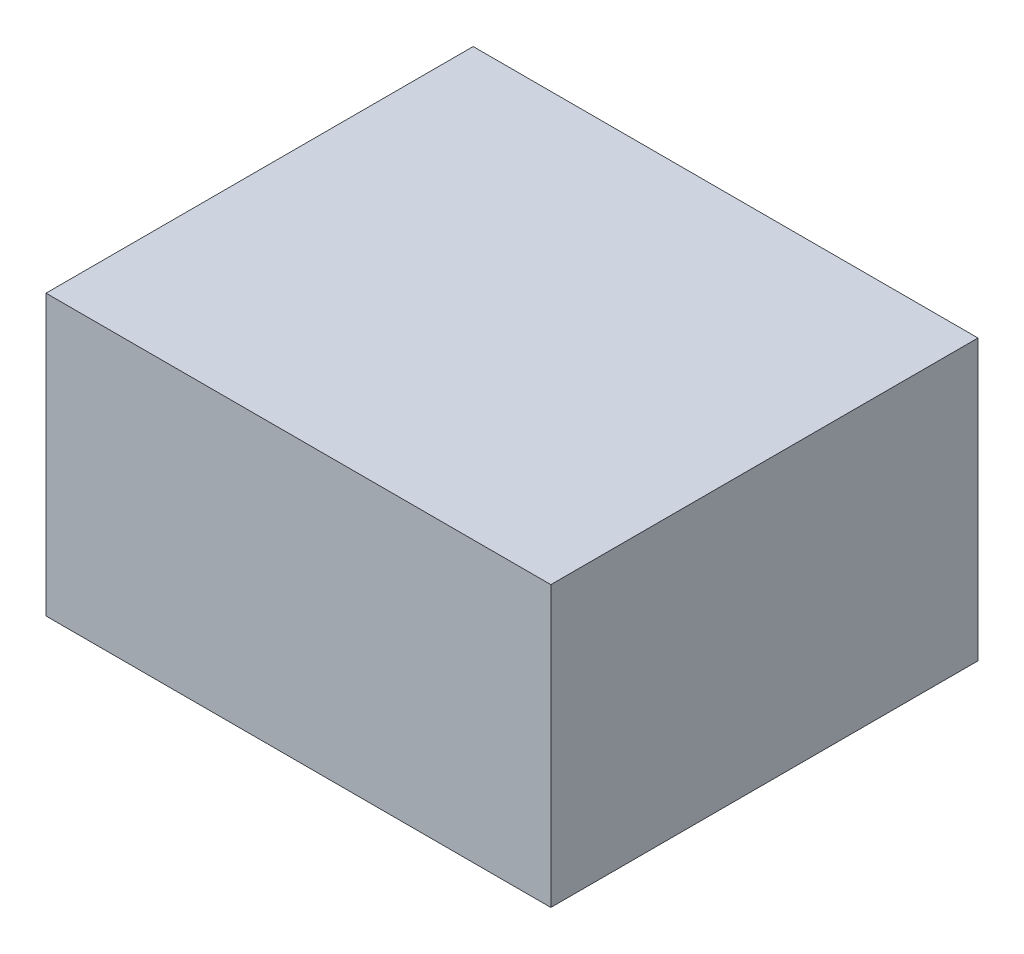
ISO-10303-21;
HEADER;
FILE_DESCRIPTION(('STEP AP214'),'2;1');
FILE_NAME('part.step','',(''),(''),'','','');
FILE_SCHEMA(('AUTOMOTIVE_DESIGN { 1 0 10303 214 1 1 1 1 }'));
ENDSEC;
DATA;
#1=APPLICATION_CONTEXT('core data for automotive mechanical design processes');
#2=APPLICATION_PROTOCOL_DEFINITION('international standard','automotive_design',2000,#1);
#3=PRODUCT_CONTEXT('',#1,'mechanical');
#4=PRODUCT('Part','Part','',(#3));
#5=PRODUCT_RELATED_PRODUCT_CATEGORY('part','',(#4));
#6=PRODUCT_DEFINITION_FORMATION('','',#4);
#7=PRODUCT_DEFINITION_CONTEXT('part definition',#1,'design');
#8=PRODUCT_DEFINITION('design','',#6,#7);
#9=PRODUCT_DEFINITION_SHAPE('','',#8);
#10=(LENGTH_UNIT() NAMED_UNIT(*) SI_UNIT(.MILLI.,.METRE.));
#11=(NAMED_UNIT(*) PLANE_ANGLE_UNIT() SI_UNIT($,.RADIAN.));
#12=(NAMED_UNIT(*) SI_UNIT($,.STERADIAN.) SOLID_ANGLE_UNIT());
#13=UNCERTAINTY_MEASURE_WITH_UNIT(LENGTH_MEASURE(1.E-05),#10,'distance_accuracy_value','');
#14=(GEOMETRIC_REPRESENTATION_CONTEXT(3) GLOBAL_UNCERTAINTY_ASSIGNED_CONTEXT((#13)) GLOBAL_UNIT_ASSIGNED_CONTEXT((#10,
#11,#12)) REPRESENTATION_CONTEXT('',''));
#15=CARTESIAN_POINT('',(0.,0.,0.));
#16=DIRECTION('',(0.,0.,1.));
#17=DIRECTION('',(1.,0.,0.));
#18=AXIS2_PLACEMENT_3D('',#15,#16,#17);
#19=CARTESIAN_POINT('',(-55.7134289009722,35.,-24.0629757785467));
#20=DIRECTION('',(1.,0.,0.));
#21=DIRECTION('',(0.,0.,-1.));
#22=AXIS2_PLACEMENT_3D('',#19,#20,#21);
#23=PLANE('',#22);
#24=DIRECTION('',(0.,0.,1.));
#25=VECTOR('',#24,1.);
#26=CARTESIAN_POINT('',(-55.7134289009722,0.,-24.0629757785467));
#27=LINE('',#26,#25);
#28=CARTESIAN_POINT('',(-55.7134289009722,0.,-24.0629757785467));
#29=VERTEX_POINT('',#28);
#30=CARTESIAN_POINT('',(-55.7134289009721,0.,30.9370242214533));
#31=VERTEX_POINT('',#30);
#32=EDGE_CURVE('E110',#29,#31,#27,.T.);
#33=ORIENTED_EDGE('',*,*,#32,.T.);
#34=DIRECTION('',(0.,-1.,0.));
#35=VECTOR('',#34,1.);
#36=CARTESIAN_POINT('',(-55.7134289009721,35.,30.9370242214533));
#37=LINE('',#36,#35);
#38=CARTESIAN_POINT('',(-55.7134289009722,36.,30.9370242214533));
#39=VERTEX_POINT('',#38);
#40=EDGE_CURVE('E11',#39,#31,#37,.T.);
#41=ORIENTED_EDGE('',*,*,#40,.F.);
#42=DIRECTION('',(0.,0.,1.));
#43=VECTOR('',#42,1.);
#44=CARTESIAN_POINT('',(-55.7134289009722,36.,-24.0629757785467));
#45=LINE('',#44,#43);
#46=CARTESIAN_POINT('',(-55.7134289009722,36.,-24.0629757785467));
#47=VERTEX_POINT('',#46);
#48=EDGE_CURVE('E108',#47,#39,#45,.T.);
#49=ORIENTED_EDGE('',*,*,#48,.F.);
#50=DIRECTION('',(0.,-1.,0.));
#51=VECTOR('',#50,1.);
#52=CARTESIAN_POINT('',(-55.7134289009722,35.,-24.0629757785467));
#53=LINE('',#52,#51);
#54=EDGE_CURVE('E168',#47,#29,#53,.T.);
#55=ORIENTED_EDGE('',*,*,#54,.T.);
#56=EDGE_LOOP('',(#33,#41,#49,#55));
#57=FACE_BOUND('',#56,.T.);
#58=ADVANCED_FACE('F40',(#57),#23,.F.);
#59=CARTESIAN_POINT('',(-55.7134289009721,35.,30.9370242214533));
#60=DIRECTION('',(0.,0.,-1.));
#61=DIRECTION('',(-1.,0.,0.));
#62=AXIS2_PLACEMENT_3D('',#59,#60,#61);
#63=PLANE('',#62);
#64=DIRECTION('',(1.,0.,0.));
#65=VECTOR('',#64,1.);
#66=CARTESIAN_POINT('',(-55.7134289009721,0.,30.9370242214533));
#67=LINE('',#66,#65);
#68=CARTESIAN_POINT('',(9.28657109902786,0.,30.9370242214533));
#69=VERTEX_POINT('',#68);
#70=EDGE_CURVE('E164',#31,#69,#67,.T.);
#71=ORIENTED_EDGE('',*,*,#70,.T.);
#72=DIRECTION('',(0.,-1.,0.));
#73=VECTOR('',#72,1.);
#74=CARTESIAN_POINT('',(9.28657109902786,35.,30.9370242214533));
#75=LINE('',#74,#73);
#76=CARTESIAN_POINT('',(9.28657109902786,36.,30.9370242214533));
#77=VERTEX_POINT('',#76);
#78=EDGE_CURVE('E48',#77,#69,#75,.T.);
#79=ORIENTED_EDGE('',*,*,#78,.F.);
#80=DIRECTION('',(1.,0.,0.));
#81=VECTOR('',#80,1.);
#82=CARTESIAN_POINT('',(-55.7134289009722,36.,30.9370242214533));
#83=LINE('',#82,#81);
#84=EDGE_CURVE('E113',#39,#77,#83,.T.);
#85=ORIENTED_EDGE('',*,*,#84,.F.);
#86=ORIENTED_EDGE('',*,*,#40,.T.);
#87=EDGE_LOOP('',(#71,#79,#85,#86));
#88=FACE_BOUND('',#87,.T.);
#89=ADVANCED_FACE('F114',(#88),#63,.F.);
#90=CARTESIAN_POINT('',(9.28657109902786,35.,-24.0629757785467));
#91=DIRECTION('',(-1.,0.,0.));
#92=DIRECTION('',(0.,0.,1.));
#93=AXIS2_PLACEMENT_3D('',#90,#91,#92);
#94=PLANE('',#93);
#95=DIRECTION('',(0.,0.,-1.));
#96=VECTOR('',#95,1.);
#97=CARTESIAN_POINT('',(9.28657109902786,0.,-24.0629757785467));
#98=LINE('',#97,#96);
#99=CARTESIAN_POINT('',(9.28657109902786,0.,-24.0629757785467));
#100=VERTEX_POINT('',#99);
#101=EDGE_CURVE('E63',#69,#100,#98,.T.);
#102=ORIENTED_EDGE('',*,*,#101,.T.);
#103=DIRECTION('',(0.,-1.,0.));
#104=VECTOR('',#103,1.);
#105=CARTESIAN_POINT('',(9.28657109902786,35.,-24.0629757785467));
#106=LINE('',#105,#104);
#107=CARTESIAN_POINT('',(9.28657109902786,36.,-24.0629757785467));
#108=VERTEX_POINT('',#107);
#109=EDGE_CURVE('E170',#108,#100,#106,.T.);
#110=ORIENTED_EDGE('',*,*,#109,.F.);
#111=DIRECTION('',(0.,0.,-1.));
#112=VECTOR('',#111,1.);
#113=CARTESIAN_POINT('',(9.28657109902786,36.,-24.0629757785467));
#114=LINE('',#113,#112);
#115=EDGE_CURVE('E118',#77,#108,#114,.T.);
#116=ORIENTED_EDGE('',*,*,#115,.F.);
#117=ORIENTED_EDGE('',*,*,#78,.T.);
#118=EDGE_LOOP('',(#102,#110,#116,#117));
#119=FACE_BOUND('',#118,.T.);
#120=ADVANCED_FACE('F171',(#119),#94,.F.);
#121=CARTESIAN_POINT('',(-55.7134289009722,35.,-24.0629757785467));
#122=DIRECTION('',(0.,0.,1.));
#123=DIRECTION('',(1.,0.,0.));
#124=AXIS2_PLACEMENT_3D('',#121,#122,#123);
#125=PLANE('',#124);
#126=DIRECTION('',(-1.,0.,0.));
#127=VECTOR('',#126,1.);
#128=CARTESIAN_POINT('',(-55.7134289009722,0.,-24.0629757785467));
#129=LINE('',#128,#127);
#130=EDGE_CURVE('E55',#100,#29,#129,.T.);
#131=ORIENTED_EDGE('',*,*,#130,.T.);
#132=ORIENTED_EDGE('',*,*,#54,.F.);
#133=DIRECTION('',(-1.,0.,0.));
#134=VECTOR('',#133,1.);
#135=CARTESIAN_POINT('',(-55.7134289009722,36.,-24.0629757785467));
#136=LINE('',#135,#134);
#137=EDGE_CURVE('E123',#108,#47,#136,.T.);
#138=ORIENTED_EDGE('',*,*,#137,.F.);
#139=ORIENTED_EDGE('',*,*,#109,.T.);
#140=EDGE_LOOP('',(#131,#132,#138,#139));
#141=FACE_BOUND('',#140,.T.);
#142=ADVANCED_FACE('F175',(#141),#125,.F.);
#143=CARTESIAN_POINT('',(0.,0.,0.));
#144=DIRECTION('',(0.,1.,0.));
#145=DIRECTION('',(0.,0.,1.));
#146=AXIS2_PLACEMENT_3D('',#143,#144,#145);
#147=PLANE('',#146);
#148=ORIENTED_EDGE('',*,*,#32,.F.);
#149=ORIENTED_EDGE('',*,*,#130,.F.);
#150=ORIENTED_EDGE('',*,*,#101,.F.);
#151=ORIENTED_EDGE('',*,*,#70,.F.);
#152=EDGE_LOOP('',(#148,#149,#150,#151));
#153=FACE_BOUND('',#152,.T.);
#154=ADVANCED_FACE('F173',(#153),#147,.F.);
#155=CARTESIAN_POINT('',(0.,36.,0.));
#156=DIRECTION('',(0.,1.,0.));
#157=DIRECTION('',(0.,0.,1.));
#158=AXIS2_PLACEMENT_3D('',#155,#156,#157);
#159=PLANE('',#158);
#160=ORIENTED_EDGE('',*,*,#48,.T.);
#161=ORIENTED_EDGE('',*,*,#84,.T.);
#162=ORIENTED_EDGE('',*,*,#115,.T.);
#163=ORIENTED_EDGE('',*,*,#137,.T.);
#164=EDGE_LOOP('',(#160,#161,#162,#163));
#165=FACE_BOUND('',#164,.T.);
#166=ADVANCED_FACE('F121',(#165),#159,.T.);
#167=CLOSED_SHELL('',(#58,#89,#120,#142,#154,#166));
#168=CARTESIAN_POINT('',(0.,1.00000000000001,0.));
#169=DIRECTION('',(0.,1.,0.));
#170=DIRECTION('',(0.,0.,1.));
#171=AXIS2_PLACEMENT_3D('',#168,#169,#170);
#172=PLANE('',#171);
#173=DIRECTION('',(0.,0.,-1.));
#174=VECTOR('',#173,1.);
#175=CARTESIAN_POINT('',(8.78657109902785,1.00000000000001,30.4370242214533));
#176=LINE('',#175,#174);
#177=CARTESIAN_POINT('',(8.78657109902785,1.00000000000001,30.4370242214533));
#178=VERTEX_POINT('',#177);
#179=CARTESIAN_POINT('',(8.78657109902785,1.00000000000001,-23.5629757785467));
#180=VERTEX_POINT('',#179);
#181=EDGE_CURVE('E129',#178,#180,#176,.T.);
#182=ORIENTED_EDGE('',*,*,#181,.T.);
#183=DIRECTION('',(-1.,0.,0.));
#184=VECTOR('',#183,1.);
#185=CARTESIAN_POINT('',(8.78657109902785,1.00000000000001,-23.5629757785467));
#186=LINE('',#185,#184);
#187=CARTESIAN_POINT('',(-55.2134289009721,1.00000000000001,-23.5629757785467));
#188=VERTEX_POINT('',#187);
#189=EDGE_CURVE('E132',#180,#188,#186,.T.);
#190=ORIENTED_EDGE('',*,*,#189,.T.);
#191=DIRECTION('',(0.,0.,1.));
#192=VECTOR('',#191,1.);
#193=CARTESIAN_POINT('',(-55.2134289009721,1.00000000000001,-23.5629757785467));
#194=LINE('',#193,#192);
#195=CARTESIAN_POINT('',(-55.2134289009721,1.00000000000001,30.4370242214533));
#196=VERTEX_POINT('',#195);
#197=EDGE_CURVE('E136',#188,#196,#194,.T.);
#198=ORIENTED_EDGE('',*,*,#197,.T.);
#199=DIRECTION('',(1.,0.,0.));
#200=VECTOR('',#199,1.);
#201=CARTESIAN_POINT('',(-55.2134289009721,1.00000000000001,30.4370242214533));
#202=LINE('',#201,#200);
#203=EDGE_CURVE('E138',#196,#178,#202,.T.);
#204=ORIENTED_EDGE('',*,*,#203,.T.);
#205=EDGE_LOOP('',(#182,#190,#198,#204));
#206=FACE_BOUND('',#205,.T.);
#207=ADVANCED_FACE('F221',(#206),#172,.T.);
#208=CARTESIAN_POINT('',(8.78657109902785,1.00000000000001,-23.5629757785467));
#209=DIRECTION('',(0.,0.,-1.));
#210=DIRECTION('',(-1.,0.,0.));
#211=AXIS2_PLACEMENT_3D('',#208,#209,#210);
#212=PLANE('',#211);
#213=DIRECTION('',(-1.,0.,0.));
#214=VECTOR('',#213,1.);
#215=CARTESIAN_POINT('',(8.78657109902785,35.,-23.5629757785467));
#216=LINE('',#215,#214);
#217=CARTESIAN_POINT('',(8.78657109902785,35.,-23.5629757785467));
#218=VERTEX_POINT('',#217);
#219=CARTESIAN_POINT('',(-55.2134289009721,35.,-23.5629757785467));
#220=VERTEX_POINT('',#219);
#221=EDGE_CURVE('E144',#218,#220,#216,.T.);
#222=ORIENTED_EDGE('',*,*,#221,.T.);
#223=DIRECTION('',(0.,1.,0.));
#224=VECTOR('',#223,1.);
#225=CARTESIAN_POINT('',(-55.2134289009721,1.00000000000001,-23.5629757785467));
#226=LINE('',#225,#224);
#227=EDGE_CURVE('E158',#188,#220,#226,.T.);
#228=ORIENTED_EDGE('',*,*,#227,.F.);
#229=ORIENTED_EDGE('',*,*,#189,.F.);
#230=DIRECTION('',(0.,1.,0.));
#231=VECTOR('',#230,1.);
#232=CARTESIAN_POINT('',(8.78657109902785,1.00000000000001,-23.5629757785467));
#233=LINE('',#232,#231);
#234=EDGE_CURVE('E141',#180,#218,#233,.T.);
#235=ORIENTED_EDGE('',*,*,#234,.T.);
#236=EDGE_LOOP('',(#222,#228,#229,#235));
#237=FACE_BOUND('',#236,.T.);
#238=ADVANCED_FACE('F225',(#237),#212,.F.);
#239=CARTESIAN_POINT('',(-55.2134289009721,1.00000000000001,29.063319013022));
#240=DIRECTION('',(-1.,0.,0.));
#241=DIRECTION('',(0.,0.,1.));
#242=AXIS2_PLACEMENT_3D('',#239,#240,#241);
#243=PLANE('',#242);
#244=DIRECTION('',(0.,0.,1.));
#245=VECTOR('',#244,1.);
#246=CARTESIAN_POINT('',(-55.2134289009721,35.,29.063319013022));
#247=LINE('',#246,#245);
#248=CARTESIAN_POINT('',(-55.2134289009721,35.,30.4370242214533));
#249=VERTEX_POINT('',#248);
#250=EDGE_CURVE('E147',#220,#249,#247,.T.);
#251=ORIENTED_EDGE('',*,*,#250,.T.);
#252=DIRECTION('',(0.,1.,0.));
#253=VECTOR('',#252,1.);
#254=CARTESIAN_POINT('',(-55.2134289009721,1.00000000000001,30.4370242214533));
#255=LINE('',#254,#253);
#256=EDGE_CURVE('E155',#196,#249,#255,.T.);
#257=ORIENTED_EDGE('',*,*,#256,.F.);
#258=ORIENTED_EDGE('',*,*,#197,.F.);
#259=ORIENTED_EDGE('',*,*,#227,.T.);
#260=EDGE_LOOP('',(#251,#257,#258,#259));
#261=FACE_BOUND('',#260,.T.);
#262=ADVANCED_FACE('F240',(#261),#243,.F.);
#263=CARTESIAN_POINT('',(-55.2134289009721,1.00000000000001,30.4370242214533));
#264=DIRECTION('',(0.,0.,1.));
#265=DIRECTION('',(1.,0.,0.));
#266=AXIS2_PLACEMENT_3D('',#263,#264,#265);
#267=PLANE('',#266);
#268=DIRECTION('',(1.,0.,0.));
#269=VECTOR('',#268,1.);
#270=CARTESIAN_POINT('',(-55.2134289009721,35.,30.4370242214533));
#271=LINE('',#270,#269);
#272=CARTESIAN_POINT('',(8.78657109902785,35.,30.4370242214533));
#273=VERTEX_POINT('',#272);
#274=EDGE_CURVE('E133',#249,#273,#271,.T.);
#275=ORIENTED_EDGE('',*,*,#274,.T.);
#276=DIRECTION('',(0.,1.,0.));
#277=VECTOR('',#276,1.);
#278=CARTESIAN_POINT('',(8.78657109902785,1.00000000000001,30.4370242214533));
#279=LINE('',#278,#277);
#280=EDGE_CURVE('E152',#178,#273,#279,.T.);
#281=ORIENTED_EDGE('',*,*,#280,.F.);
#282=ORIENTED_EDGE('',*,*,#203,.F.);
#283=ORIENTED_EDGE('',*,*,#256,.T.);
#284=EDGE_LOOP('',(#275,#281,#282,#283));
#285=FACE_BOUND('',#284,.T.);
#286=ADVANCED_FACE('F247',(#285),#267,.F.);
#287=CARTESIAN_POINT('',(8.78657109902785,1.00000000000001,30.4370242214533));
#288=DIRECTION('',(1.,0.,0.));
#289=DIRECTION('',(0.,0.,-1.));
#290=AXIS2_PLACEMENT_3D('',#287,#288,#289);
#291=PLANE('',#290);
#292=DIRECTION('',(0.,0.,-1.));
#293=VECTOR('',#292,1.);
#294=CARTESIAN_POINT('',(8.78657109902785,35.,30.4370242214533));
#295=LINE('',#294,#293);
#296=EDGE_CURVE('E128',#273,#218,#295,.T.);
#297=ORIENTED_EDGE('',*,*,#296,.T.);
#298=ORIENTED_EDGE('',*,*,#234,.F.);
#299=ORIENTED_EDGE('',*,*,#181,.F.);
#300=ORIENTED_EDGE('',*,*,#280,.T.);
#301=EDGE_LOOP('',(#297,#298,#299,#300));
#302=FACE_BOUND('',#301,.T.);
#303=ADVANCED_FACE('F255',(#302),#291,.F.);
#304=CARTESIAN_POINT('',(0.,35.,0.));
#305=DIRECTION('',(0.,1.,0.));
#306=DIRECTION('',(0.,0.,1.));
#307=AXIS2_PLACEMENT_3D('',#304,#305,#306);
#308=PLANE('',#307);
#309=ORIENTED_EDGE('',*,*,#296,.F.);
#310=ORIENTED_EDGE('',*,*,#274,.F.);
#311=ORIENTED_EDGE('',*,*,#250,.F.);
#312=ORIENTED_EDGE('',*,*,#221,.F.);
#313=EDGE_LOOP('',(#309,#310,#311,#312));
#314=FACE_BOUND('',#313,.T.);
#315=ADVANCED_FACE('F263',(#314),#308,.F.);
#316=CLOSED_SHELL('',(#207,#238,#262,#286,#303,#315));
#317=ORIENTED_CLOSED_SHELL('',*,#316,.T.);
#318=BREP_WITH_VOIDS('B2',#167,(#317));
#319=ADVANCED_BREP_SHAPE_REPRESENTATION('',(#18,#318),#14);
#320=SHAPE_DEFINITION_REPRESENTATION(#9,#319);
ENDSEC;
END-ISO-10303-21;
